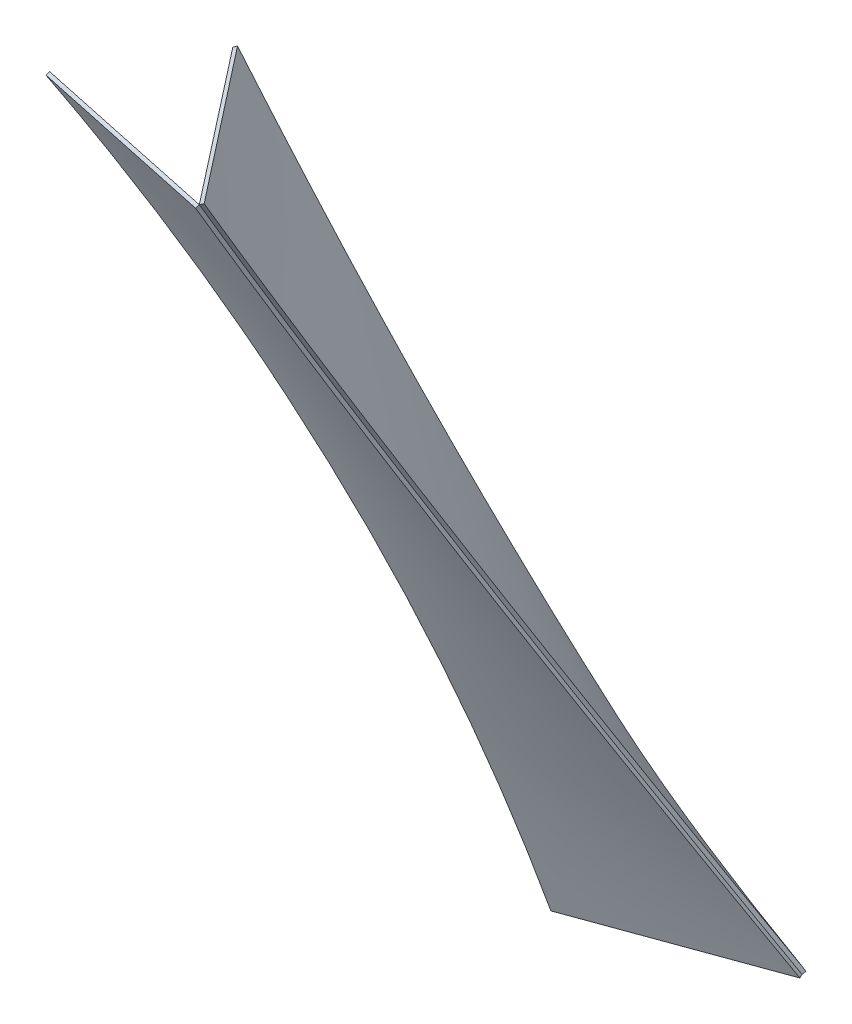
ISO-10303-21;
HEADER;
FILE_DESCRIPTION(('STEP AP214'),'2;1');
FILE_NAME('part.step','',(''),(''),'','','');
FILE_SCHEMA(('AUTOMOTIVE_DESIGN { 1 0 10303 214 1 1 1 1 }'));
ENDSEC;
DATA;
#1=APPLICATION_CONTEXT('core data for automotive mechanical design processes');
#2=APPLICATION_PROTOCOL_DEFINITION('international standard','automotive_design',2000,#1);
#3=PRODUCT_CONTEXT('',#1,'mechanical');
#4=PRODUCT('Part','Part','',(#3));
#5=PRODUCT_RELATED_PRODUCT_CATEGORY('part','',(#4));
#6=PRODUCT_DEFINITION_FORMATION('','',#4);
#7=PRODUCT_DEFINITION_CONTEXT('part definition',#1,'design');
#8=PRODUCT_DEFINITION('design','',#6,#7);
#9=PRODUCT_DEFINITION_SHAPE('','',#8);
#10=(LENGTH_UNIT() NAMED_UNIT(*) SI_UNIT(.MILLI.,.METRE.));
#11=(NAMED_UNIT(*) PLANE_ANGLE_UNIT() SI_UNIT($,.RADIAN.));
#12=(NAMED_UNIT(*) SI_UNIT($,.STERADIAN.) SOLID_ANGLE_UNIT());
#13=UNCERTAINTY_MEASURE_WITH_UNIT(LENGTH_MEASURE(1.E-05),#10,'distance_accuracy_value','');
#14=(GEOMETRIC_REPRESENTATION_CONTEXT(3) GLOBAL_UNCERTAINTY_ASSIGNED_CONTEXT((#13)) GLOBAL_UNIT_ASSIGNED_CONTEXT((#10,
#11,#12)) REPRESENTATION_CONTEXT('',''));
#15=CARTESIAN_POINT('',(0.,0.,0.));
#16=DIRECTION('',(0.,0.,1.));
#17=DIRECTION('',(1.,0.,0.));
#18=AXIS2_PLACEMENT_3D('',#15,#16,#17);
#19=CARTESIAN_POINT('',(283.480426248597,407.115147940274,134.215304998314));
#20=CARTESIAN_POINT('',(293.102632967215,372.599813988946,123.718075802583));
#21=CARTESIAN_POINT('',(301.730189499787,338.148503673204,112.263899554851));
#22=CARTESIAN_POINT('',(313.118219793948,286.690694139485,93.6386744379849));
#23=CARTESIAN_POINT('',(316.654750853913,269.574875919136,87.1888587177726));
#24=CARTESIAN_POINT('',(323.196441224416,235.437062259907,73.8110502946261));
#25=CARTESIAN_POINT('',(326.200974825531,218.415172317269,66.8828669971953));
#26=CARTESIAN_POINT('',(331.677480906214,184.480145481782,52.5723951322629));
#27=CARTESIAN_POINT('',(334.149751051378,167.566727617744,45.1912092604749));
#28=CARTESIAN_POINT('',(338.583723177891,133.860064286484,30.0067544442615));
#29=CARTESIAN_POINT('',(340.546503163389,117.06675236686,22.2037122896409));
#30=CARTESIAN_POINT('',(345.697435375216,66.8905448792094,-1.82230548124379));
#31=CARTESIAN_POINT('',(348.151520961227,33.7120815255412,-18.6648831358462));
#32=CARTESIAN_POINT('',(349.602823048063,0.876255361734513,-36.3306762111318));
#33=CARTESIAN_POINT('',(282.095540384845,406.400000000001,135.297296418014));
#34=CARTESIAN_POINT('',(291.690847970146,371.891500338426,124.770155061567));
#35=CARTESIAN_POINT('',(300.296873923827,337.451560864584,113.293710597361));
#36=CARTESIAN_POINT('',(311.704963453109,285.997877254039,94.6983478910511));
#37=CARTESIAN_POINT('',(315.25750172933,268.881020317227,88.2697776539477));
#38=CARTESIAN_POINT('',(321.859423989057,234.733279196778,74.9596149516806));
#39=CARTESIAN_POINT('',(324.908807972563,217.702395013142,68.0780224865168));
#40=CARTESIAN_POINT('',(330.501583821225,183.743830285482,53.8690251034019));
#41=CARTESIAN_POINT('',(333.044975686381,166.816149741458,46.5416201854508));
#42=CARTESIAN_POINT('',(337.622929472709,133.081223179458,31.4482076720342));
#43=CARTESIAN_POINT('',(339.65749139388,116.273977161482,23.6822000765688));
#44=CARTESIAN_POINT('',(344.993675502965,66.058737226281,-0.262912063189253));
#45=CARTESIAN_POINT('',(347.527796036448,32.8572414277833,-17.0891059608437));
#46=CARTESIAN_POINT('',(349.027229728152,2.22044604925031E-13,-34.7492465618884));
#47=B_SPLINE_SURFACE_WITH_KNOTS('',1,3,((#19,#20,#21,#22,#23,#24,#25,#26,#27,#28,#29,#30,#31,
#32),(#33,#34,#35,#36,#37,#38,#39,#40,#41,#42,#43,#44,#45,#46)),.UNSPECIFIED.,.F.,.F.,.F.,(2,2),
(4,2,2,2,2,2,4),(0.,1.),(0.,0.25,0.375,0.5,0.625,0.75,1.),.UNSPECIFIED.);
#48=CARTESIAN_POINT('',(349.027229728152,2.22044604925031E-13,-34.7492465618884));
#49=CARTESIAN_POINT('',(349.602823048063,0.876255361734513,-36.3306762111318));
#50=B_SPLINE_CURVE_WITH_KNOTS('',1,(#48,#49),.UNSPECIFIED.,.F.,.F.,(2,2),(0.,1.),.UNSPECIFIED.);
#51=CARTESIAN_POINT('',(349.027229728152,2.22044604925031E-13,-34.7492465618884));
#52=VERTEX_POINT('',#51);
#53=CARTESIAN_POINT('',(349.602823048063,0.876255361734513,-36.3306762111318));
#54=VERTEX_POINT('',#53);
#55=EDGE_CURVE('E15',#52,#54,#50,.T.);
#56=CARTESIAN_POINT('',(349.027229728152,2.22044604925031E-13,-34.7492465618884));
#57=CARTESIAN_POINT('',(347.527796036448,32.8572414277833,-17.0891059608437));
#58=CARTESIAN_POINT('',(344.993675502965,66.058737226281,-0.262912063189253));
#59=CARTESIAN_POINT('',(339.65749139388,116.273977161482,23.6822000765688));
#60=CARTESIAN_POINT('',(337.622929472709,133.081223179458,31.4482076720342));
#61=CARTESIAN_POINT('',(333.044975686381,166.816149741458,46.5416201854508));
#62=CARTESIAN_POINT('',(330.501583821225,183.743830285482,53.8690251034019));
#63=CARTESIAN_POINT('',(324.908807972563,217.702395013142,68.0780224865168));
#64=CARTESIAN_POINT('',(321.859423989057,234.733279196778,74.9596149516806));
#65=CARTESIAN_POINT('',(315.25750172933,268.881020317227,88.2697776539477));
#66=CARTESIAN_POINT('',(311.704963453109,285.997877254039,94.6983478910511));
#67=CARTESIAN_POINT('',(300.296873923827,337.451560864584,113.293710597361));
#68=CARTESIAN_POINT('',(291.690847970146,371.891500338426,124.770155061567));
#69=CARTESIAN_POINT('',(282.095540384845,406.400000000001,135.297296418014));
#70=B_SPLINE_CURVE_WITH_KNOTS('',3,(#56,#57,#58,#59,#60,#61,#62,#63,#64,#65,#66,#67,#68,#69),
.UNSPECIFIED.,.F.,.F.,(4,2,2,2,2,2,4),(0.,0.25,0.375,0.5,0.625,0.75,1.),.UNSPECIFIED.);
#71=CARTESIAN_POINT('',(282.095540384845,406.400000000001,135.297296418014));
#72=VERTEX_POINT('',#71);
#73=EDGE_CURVE('E400',#52,#72,#70,.T.);
#74=CARTESIAN_POINT('',(282.095540384845,406.400000000001,135.297296418014));
#75=CARTESIAN_POINT('',(283.480426248597,407.115147940274,134.215304998314));
#76=B_SPLINE_CURVE_WITH_KNOTS('',1,(#74,#75),.UNSPECIFIED.,.F.,.F.,(2,2),(0.,1.),.UNSPECIFIED.);
#77=CARTESIAN_POINT('',(283.480426306331,407.11514773318,134.215304935329));
#78=VERTEX_POINT('',#77);
#79=EDGE_CURVE('E233',#72,#78,#76,.T.);
#80=CARTESIAN_POINT('',(349.602823047882,0.876255361737849,-36.3306762111956));
#81=CARTESIAN_POINT('',(349.240099871018,9.08263790563876,-31.9155675708201));
#82=CARTESIAN_POINT('',(348.814421145769,17.313102822965,-27.5504380648379));
#83=CARTESIAN_POINT('',(347.83834770597,33.8147195839394,-18.9232109441992));
#84=CARTESIAN_POINT('',(347.288021832485,42.0858465129696,-14.6610578894712));
#85=CARTESIAN_POINT('',(346.063726222946,58.6665829690197,-6.23990835929512));
#86=CARTESIAN_POINT('',(345.389812897087,66.9761732599296,-2.0808657993416));
#87=CARTESIAN_POINT('',(343.918974637038,83.6315979927871,6.1341252225925));
#88=CARTESIAN_POINT('',(343.122093925375,91.9774183608499,10.1901101386662));
#89=CARTESIAN_POINT('',(341.405092606518,108.703085728666,18.1989179077324));
#90=CARTESIAN_POINT('',(340.485004405005,117.082923221257,22.1517675615271));
#91=CARTESIAN_POINT('',(338.520096268837,133.874519131975,29.9536311949481));
#92=CARTESIAN_POINT('',(337.475297405871,142.286271925648,33.8026625818279));
#93=CARTESIAN_POINT('',(335.25826603073,159.139841829301,41.3949956240023));
#94=CARTESIAN_POINT('',(334.086043777893,167.58165646603,45.1383057607868));
#95=CARTESIAN_POINT('',(331.611071659999,184.493790904879,52.5158625680249));
#96=CARTESIAN_POINT('',(330.308321777823,192.964110710737,56.1501092241751));
#97=CARTESIAN_POINT('',(327.570033861583,209.931827308746,63.3054144531532));
#98=CARTESIAN_POINT('',(326.134486123337,218.429226035806,66.8264647288001));
#99=CARTESIAN_POINT('',(323.129911697326,235.449456568774,73.7516683537776));
#100=CARTESIAN_POINT('',(321.560866234747,243.972291788835,77.1558051658582));
#101=CARTESIAN_POINT('',(318.289988246234,261.041408137913,83.8447942325126));
#102=CARTESIAN_POINT('',(316.588128369784,269.58769374461,87.1296217125031));
#103=CARTESIAN_POINT('',(313.053125301255,286.701080241914,93.5788975415301));
#104=CARTESIAN_POINT('',(311.219946442472,295.268186172347,96.7433128261156));
#105=CARTESIAN_POINT('',(305.52482721177,321.002145563866,106.057744949643));
#106=CARTESIAN_POINT('',(301.46895343523,338.193046426016,112.025581623156));
#107=CARTESIAN_POINT('',(295.007343562105,364.010568217198,120.615407924424));
#108=CARTESIAN_POINT('',(292.789617596806,372.624793055725,123.419331123184));
#109=CARTESIAN_POINT('',(288.228624447749,389.863862572055,128.907497574661));
#110=CARTESIAN_POINT('',(285.885286716036,398.488710502474,131.591671988465));
#111=CARTESIAN_POINT('',(283.480426306084,407.115147733405,134.215304935163));
#112=B_SPLINE_CURVE_WITH_KNOTS('',3,(#80,#81,#82,#83,#84,#85,#86,#87,#88,#89,#90,#91,#92,#93,
#94,#95,#96,#97,#98,#99,#100,#101,#102,#103,#104,#105,#106,#107,#108,#109,#110,#111),
.UNSPECIFIED.,.F.,.F.,(4,2,2,2,2,2,2,2,2,2,2,2,2,2,2,4),(0.,27.9768177414112,55.9382217495732,
83.8868946907719,111.82553982812,139.756851003789,167.683449439103,195.607801061416,
223.532156345865,251.458553812186,279.38888529546,307.324983735459,335.268698699666,
391.184239540729,419.162696518367,447.157035260678),.UNSPECIFIED.);
#113=EDGE_CURVE('E286',#54,#78,#112,.T.);
#114=ORIENTED_EDGE('',*,*,#55,.F.);
#115=ORIENTED_EDGE('',*,*,#73,.T.);
#116=ORIENTED_EDGE('',*,*,#79,.T.);
#117=ORIENTED_EDGE('',*,*,#113,.F.);
#118=EDGE_LOOP('',(#114,#115,#116,#117));
#119=FACE_BOUND('',#118,.T.);
#120=ADVANCED_FACE('F219',(#119),#47,.F.);
#121=CARTESIAN_POINT('',(283.480426248597,407.115147940274,134.215304998314));
#122=CARTESIAN_POINT('',(304.341655745825,407.081381650881,160.894143123353));
#123=CARTESIAN_POINT('',(325.202523604188,407.045959245197,187.573263792203));
#124=CARTESIAN_POINT('',(346.062833931183,407.008846790874,214.2528200551));
#125=CARTESIAN_POINT('',(282.095540384845,406.400000000001,135.297296418014));
#126=CARTESIAN_POINT('',(302.9459423492,406.400000000001,161.984593940168));
#127=CARTESIAN_POINT('',(323.796344313554,406.400000000001,188.671891462322));
#128=CARTESIAN_POINT('',(344.646746277909,406.4,215.359188984475));
#129=B_SPLINE_SURFACE_WITH_KNOTS('',1,3,((#121,#122,#123,#124),(#125,#126,#127,#128)),
.UNSPECIFIED.,.F.,.F.,.F.,(2,2),(4,4),(0.,1.),(-0.0508,0.0508),.UNSPECIFIED.);
#130=CARTESIAN_POINT('',(282.095540384845,406.400000000001,135.297296418014));
#131=CARTESIAN_POINT('',(302.9459423492,406.400000000001,161.984593940168));
#132=CARTESIAN_POINT('',(323.796344313554,406.400000000001,188.671891462322));
#133=CARTESIAN_POINT('',(344.646746277909,406.4,215.359188984475));
#134=B_SPLINE_CURVE_WITH_KNOTS('',3,(#130,#131,#132,#133),.UNSPECIFIED.,.F.,.F.,(4,4),(-0.0508,
0.0508),.UNSPECIFIED.);
#135=CARTESIAN_POINT('',(344.646746277909,406.4,215.359188984476));
#136=VERTEX_POINT('',#135);
#137=EDGE_CURVE('E269',#72,#136,#134,.T.);
#138=CARTESIAN_POINT('',(344.646746277909,406.4,215.359188984475));
#139=CARTESIAN_POINT('',(346.062833931183,407.008846790874,214.2528200551));
#140=B_SPLINE_CURVE_WITH_KNOTS('',1,(#138,#139),.UNSPECIFIED.,.F.,.F.,(2,2),(0.,1.),.UNSPECIFIED.);
#141=CARTESIAN_POINT('',(346.062833931183,407.008846790874,214.2528200551));
#142=VERTEX_POINT('',#141);
#143=EDGE_CURVE('E263',#136,#142,#140,.T.);
#144=CARTESIAN_POINT('',(283.480426248359,407.115147940457,134.21530499813));
#145=CARTESIAN_POINT('',(286.088079947018,407.110927158042,137.550159783986));
#146=CARTESIAN_POINT('',(288.695727945964,407.106680561834,140.885018994006));
#147=CARTESIAN_POINT('',(293.911011848777,407.098135536436,147.554746863921));
#148=CARTESIAN_POINT('',(296.518647752643,407.093837107244,150.889615523814));
#149=CARTESIAN_POINT('',(301.733906741269,407.085188210523,157.559362858737));
#150=CARTESIAN_POINT('',(304.341529826029,407.080837742994,160.894241533766));
#151=CARTESIAN_POINT('',(309.556762432614,407.072084597095,167.564009480514));
#152=CARTESIAN_POINT('',(312.164371954438,407.067681918725,170.898898752233));
#153=CARTESIAN_POINT('',(317.379576677345,407.058824201823,177.568688484272));
#154=CARTESIAN_POINT('',(319.987171878427,407.054369163289,180.903588944592));
#155=CARTESIAN_POINT('',(325.202347186215,407.045406606439,187.573401658213));
#156=CARTESIAN_POINT('',(327.809927292921,407.040899088121,190.908313911514));
#157=CARTESIAN_POINT('',(333.0250716247,407.031831478119,197.578150825739));
#158=CARTESIAN_POINT('',(335.632635849773,407.027271386435,200.913075486664));
#159=CARTESIAN_POINT('',(340.847747613793,407.018098574256,207.582937845549));
#160=CARTESIAN_POINT('',(343.45529515274,407.013485853759,210.917875543509));
#161=CARTESIAN_POINT('',(346.06283393083,407.008846791162,214.252820054807));
#162=B_SPLINE_CURVE_WITH_KNOTS('',3,(#144,#145,#146,#147,#148,#149,#150,#151,#152,#153,#154,
#155,#156,#157,#158,#159,#160,#161),.UNSPECIFIED.,.F.,.F.,(4,2,2,2,2,2,2,2,4),(0.,
12.700007426256,25.4000149913132,38.1000226958042,50.8000305422378,63.5000385317466,
76.2000466656416,88.9000549442848,101.600063371033),.UNSPECIFIED.);
#163=EDGE_CURVE('E267',#78,#142,#162,.T.);
#164=ORIENTED_EDGE('',*,*,#79,.F.);
#165=ORIENTED_EDGE('',*,*,#137,.T.);
#166=ORIENTED_EDGE('',*,*,#143,.T.);
#167=ORIENTED_EDGE('',*,*,#163,.F.);
#168=EDGE_LOOP('',(#164,#165,#166,#167));
#169=FACE_BOUND('',#168,.T.);
#170=ADVANCED_FACE('F266',(#169),#129,.T.);
#171=CARTESIAN_POINT('',(346.062833931183,407.008846790874,214.2528200551));
#172=CARTESIAN_POINT('',(344.503124445613,373.004718761286,193.543643428624));
#173=CARTESIAN_POINT('',(345.478135380388,338.761934274698,173.375025250805));
#174=CARTESIAN_POINT('',(350.620764703854,287.372750087332,144.056243355413));
#175=CARTESIAN_POINT('',(352.947843977509,270.238870368892,134.438558044962));
#176=CARTESIAN_POINT('',(358.809014509915,236.011678012852,115.540490642943));
#177=CARTESIAN_POINT('',(362.3427141303,218.918123985283,106.260050024696));
#178=CARTESIAN_POINT('',(370.611102554996,184.814573098306,88.0781879981933));
#179=CARTESIAN_POINT('',(375.346284493722,167.804131136307,79.1774958532089));
#180=CARTESIAN_POINT('',(386.02706520242,133.916301981808,61.8022544967587));
#181=CARTESIAN_POINT('',(391.97334138883,117.039171021898,53.3278721957763));
#182=CARTESIAN_POINT('',(411.630740066822,66.6986870500157,28.5948082588322));
#183=CARTESIAN_POINT('',(427.162584969943,33.528869652693,13.0252852567222));
#184=CARTESIAN_POINT('',(445.054462602135,0.985877948736179,-1.52337347929811));
#185=CARTESIAN_POINT('',(344.646746277909,406.4,215.359188984476));
#186=CARTESIAN_POINT('',(343.069760960772,372.365283308004,194.611067030106));
#187=CARTESIAN_POINT('',(344.038685553392,338.082034115787,174.40936039772));
#188=CARTESIAN_POINT('',(349.230626413037,286.611224709503,145.099634502726));
#189=CARTESIAN_POINT('',(351.584365694704,269.446632304415,135.495198213326));
#190=CARTESIAN_POINT('',(357.524643765958,235.156612810315,116.646138830824));
#191=CARTESIAN_POINT('',(361.111182555544,218.031185721302,107.401515737721));
#192=CARTESIAN_POINT('',(369.503674493647,183.873974048082,89.300951259582));
#193=CARTESIAN_POINT('',(374.309627642165,166.842189463874,80.4450098745455));
#194=CARTESIAN_POINT('',(385.127563149145,132.926739988992,63.1506773243072));
#195=CARTESIAN_POINT('',(391.139545507607,116.043075098317,54.7122861591054));
#196=CARTESIAN_POINT('',(410.964458674432,65.6959757496868,30.0667407609053));
#197=CARTESIAN_POINT('',(426.566355574231,32.5364366151237,14.5292146253119));
#198=CARTESIAN_POINT('',(444.5,-1.66533453693773E-13,0.));
#199=B_SPLINE_SURFACE_WITH_KNOTS('',1,3,((#171,#172,#173,#174,#175,#176,#177,#178,#179,#180,
#181,#182,#183,#184),(#185,#186,#187,#188,#189,#190,#191,#192,#193,#194,#195,#196,#197,#198)),
.UNSPECIFIED.,.F.,.F.,.F.,(2,2),(4,2,2,2,2,2,4),(0.,1.),(0.,0.25,0.375,0.5,0.625,0.75,1.),.UNSPECIFIED.);
#200=CARTESIAN_POINT('',(344.646746277909,406.4,215.359188984476));
#201=CARTESIAN_POINT('',(343.069760960772,372.365283308004,194.611067030106));
#202=CARTESIAN_POINT('',(344.038685553392,338.082034115787,174.40936039772));
#203=CARTESIAN_POINT('',(349.230626413037,286.611224709503,145.099634502726));
#204=CARTESIAN_POINT('',(351.584365694704,269.446632304415,135.495198213326));
#205=CARTESIAN_POINT('',(357.524643765958,235.156612810315,116.646138830824));
#206=CARTESIAN_POINT('',(361.111182555544,218.031185721302,107.401515737721));
#207=CARTESIAN_POINT('',(369.503674493647,183.873974048082,89.300951259582));
#208=CARTESIAN_POINT('',(374.309627642165,166.842189463874,80.4450098745455));
#209=CARTESIAN_POINT('',(385.127563149145,132.926739988992,63.1506773243072));
#210=CARTESIAN_POINT('',(391.139545507607,116.043075098317,54.7122861591054));
#211=CARTESIAN_POINT('',(410.964458674432,65.6959757496868,30.0667407609053));
#212=CARTESIAN_POINT('',(426.566355574231,32.5364366151237,14.5292146253119));
#213=CARTESIAN_POINT('',(444.5,-1.66533453693773E-13,0.));
#214=B_SPLINE_CURVE_WITH_KNOTS('',3,(#200,#201,#202,#203,#204,#205,#206,#207,#208,#209,#210,
#211,#212,#213),.UNSPECIFIED.,.F.,.F.,(4,2,2,2,2,2,4),(0.,0.25,0.375,0.5,0.625,0.75,1.),.UNSPECIFIED.);
#215=CARTESIAN_POINT('',(444.5,-1.66533453693773E-13,0.));
#216=VERTEX_POINT('',#215);
#217=EDGE_CURVE('E288',#136,#216,#214,.T.);
#218=CARTESIAN_POINT('',(444.5,-1.66533453693773E-13,0.));
#219=CARTESIAN_POINT('',(445.054462602135,0.985877948736179,-1.52337347929811));
#220=B_SPLINE_CURVE_WITH_KNOTS('',1,(#218,#219),.UNSPECIFIED.,.F.,.F.,(2,2),(0.,1.),.UNSPECIFIED.);
#221=CARTESIAN_POINT('',(445.054462602135,0.985877948736179,-1.52337347929811));
#222=VERTEX_POINT('',#221);
#223=EDGE_CURVE('E276',#216,#222,#220,.T.);
#224=CARTESIAN_POINT('',(346.06283393083,407.008846791162,214.252820054807));
#225=CARTESIAN_POINT('',(345.673220678684,398.516785906841,209.080934559933));
#226=CARTESIAN_POINT('',(345.441376011304,390.000450383714,203.93709665155));
#227=CARTESIAN_POINT('',(345.29258712934,372.944736941613,193.719655690365));
#228=CARTESIAN_POINT('',(345.375052349292,364.405432332403,188.645938878207));
#229=CARTESIAN_POINT('',(345.852411988717,347.31085964554,178.571399732848));
#230=CARTESIAN_POINT('',(346.246811685106,338.755638228495,173.570474732579));
#231=CARTESIAN_POINT('',(347.345296055367,321.636224812641,163.643983500109));
#232=CARTESIAN_POINT('',(348.048979811253,313.072058699416,158.718328222776));
#233=CARTESIAN_POINT('',(349.763267923625,295.941512626446,148.944928169261));
#234=CARTESIAN_POINT('',(350.773563020718,287.375143547528,144.097110047447));
#235=CARTESIAN_POINT('',(353.098413910572,270.246560033643,134.482322466021));
#236=CARTESIAN_POINT('',(354.412750033675,261.684347050233,129.715297289582));
#237=CARTESIAN_POINT('',(357.343467267171,244.569945640804,120.265818765671));
#238=CARTESIAN_POINT('',(358.959715991428,236.017754467986,115.583329333146));
#239=CARTESIAN_POINT('',(362.492923028898,218.928850252268,106.307689042516));
#240=CARTESIAN_POINT('',(364.409833622508,210.392134970234,101.714524137061));
#241=CARTESIAN_POINT('',(368.544218574985,193.339590732998,92.6231960090914));
#242=CARTESIAN_POINT('',(370.761727153518,184.823764268283,88.1250436701601));
#243=CARTESIAN_POINT('',(375.498165743119,167.818884994016,79.2296717990902));
#244=CARTESIAN_POINT('',(378.017209399642,159.32984352445,74.832491070968));
#245=CARTESIAN_POINT('',(383.357833243138,142.385218246143,66.1445052380803));
#246=CARTESIAN_POINT('',(386.179604282424,133.929659070155,61.8537693641369));
#247=CARTESIAN_POINT('',(392.126203017669,117.059369260881,53.3832316996979));
#248=CARTESIAN_POINT('',(395.251296742446,108.644681389779,49.2035314599015));
#249=CARTESIAN_POINT('',(401.804035941413,91.863818006113,40.9588263133719));
#250=CARTESIAN_POINT('',(405.232020865737,83.4977084133323,36.8939570037441));
#251=CARTESIAN_POINT('',(412.389076001461,66.8216489525706,28.8821960316776));
#252=CARTESIAN_POINT('',(416.118557873769,58.5117932496399,24.9354761123918));
#253=CARTESIAN_POINT('',(423.876540102027,41.9557067753692,17.1631169559071));
#254=CARTESIAN_POINT('',(427.905523912314,33.7096036809521,13.337688353123));
#255=CARTESIAN_POINT('',(436.260033995469,17.2881865709434,5.81098391783739));
#256=CARTESIAN_POINT('',(440.586115539097,9.11303914652983,2.10996093700732));
#257=CARTESIAN_POINT('',(445.054462602134,0.985877948714294,-1.52337347931256));
#258=B_SPLINE_CURVE_WITH_KNOTS('',3,(#224,#225,#226,#227,#228,#229,#230,#231,#232,#233,#234,
#235,#236,#237,#238,#239,#240,#241,#242,#243,#244,#245,#246,#247,#248,#249,#250,#251,#252,#253,
#254,#255,#256,#257),.UNSPECIFIED.,.F.,.F.,(4,2,2,2,2,2,2,2,2,2,2,2,2,2,2,2,4),(0.,
29.8505538917363,59.645048433408,89.39238391077,119.101271791318,148.780293235259,
178.437938190144,208.082608915207,237.722579333277,267.365926763306,297.020481850919,
326.693843543077,356.393469520957,386.126812588023,415.901462114417,445.725263423091,
475.606407253072),.UNSPECIFIED.);
#259=EDGE_CURVE('E284',#142,#222,#258,.T.);
#260=ORIENTED_EDGE('',*,*,#143,.F.);
#261=ORIENTED_EDGE('',*,*,#217,.T.);
#262=ORIENTED_EDGE('',*,*,#223,.T.);
#263=ORIENTED_EDGE('',*,*,#259,.F.);
#264=EDGE_LOOP('',(#260,#261,#262,#263));
#265=FACE_BOUND('',#264,.T.);
#266=ADVANCED_FACE('F293',(#265),#199,.T.);
#267=CARTESIAN_POINT('',(445.054462602135,0.985877948736179,-1.52337347929812));
#268=CARTESIAN_POINT('',(413.237453128719,0.951034516117287,-13.1263674114279));
#269=CARTESIAN_POINT('',(381.420272937055,0.914478748856112,-24.7288923003632));
#270=CARTESIAN_POINT('',(349.602823048063,0.876255361734513,-36.3306762111318));
#271=CARTESIAN_POINT('',(444.5,-1.66533453693773E-13,0.));
#272=CARTESIAN_POINT('',(412.675743242718,0.,-11.583082187296));
#273=CARTESIAN_POINT('',(380.851486485435,0.,-23.1661643745923));
#274=CARTESIAN_POINT('',(349.027229728152,2.22044604925031E-13,-34.7492465618884));
#275=B_SPLINE_SURFACE_WITH_KNOTS('',1,3,((#267,#268,#269,#270),(#271,#272,#273,#274)),
.UNSPECIFIED.,.F.,.F.,.F.,(2,2),(4,4),(0.,1.),(-0.0507999999999999,0.0507999999999999),.UNSPECIFIED.);
#276=CARTESIAN_POINT('',(444.5,-1.66533453693773E-13,0.));
#277=CARTESIAN_POINT('',(412.675743242718,0.,-11.583082187296));
#278=CARTESIAN_POINT('',(380.851486485435,0.,-23.1661643745923));
#279=CARTESIAN_POINT('',(349.027229728152,2.22044604925031E-13,-34.7492465618884));
#280=B_SPLINE_CURVE_WITH_KNOTS('',3,(#276,#277,#278,#279),.UNSPECIFIED.,.F.,.F.,(4,4),
(-0.0507999999999999,0.0507999999999999),.UNSPECIFIED.);
#281=EDGE_CURVE('E394',#216,#52,#280,.T.);
#282=CARTESIAN_POINT('',(445.054462602134,0.985877948714294,-1.52337347931256));
#283=CARTESIAN_POINT('',(441.077336395688,0.98152252600055,-2.97374772601556));
#284=CARTESIAN_POINT('',(437.1002075329,0.977140436234541,-4.42411460859462));
#285=CARTESIAN_POINT('',(429.145944077765,0.968322994860882,-7.32483263191693));
#286=CARTESIAN_POINT('',(425.168809485418,0.963887643252667,-8.77518377266001));
#287=CARTESIAN_POINT('',(417.214534196683,0.954963750502792,-11.6758692832613));
#288=CARTESIAN_POINT('',(413.237393500296,0.950475209360568,-13.1262036531194));
#289=CARTESIAN_POINT('',(405.28310562258,0.941445055787956,-16.0268545757377));
#290=CARTESIAN_POINT('',(401.305958441251,0.936903443357004,-17.4771711284978));
#291=CARTESIAN_POINT('',(393.35165720866,0.92776730040043,-20.3777853591345));
#292=CARTESIAN_POINT('',(389.374503157397,0.923172769874245,-21.8280830370109));
#293=CARTESIAN_POINT('',(381.420187795695,0.913930984041799,-24.7286584480455));
#294=CARTESIAN_POINT('',(377.443026485256,0.90928372873498,-26.1789361812034));
#295=CARTESIAN_POINT('',(369.48869621212,0.899936722766198,-29.0794706233935));
#296=CARTESIAN_POINT('',(365.511527249423,0.89523697210368,-30.5297273324254));
#297=CARTESIAN_POINT('',(357.557181274638,0.885785256924368,-33.43021863502));
#298=CARTESIAN_POINT('',(353.580004262549,0.881033292407027,-34.8804532285824));
#299=CARTESIAN_POINT('',(349.602823047882,0.876255361737849,-36.3306762111956));
#300=B_SPLINE_CURVE_WITH_KNOTS('',3,(#282,#283,#284,#285,#286,#287,#288,#289,#290,#291,#292,
#293,#294,#295,#296,#297,#298,#299),.UNSPECIFIED.,.F.,.F.,(4,2,2,2,2,2,2,2,4),(0.,
12.7000092749063,25.4000186849667,38.1000282299548,50.8000379099932,63.5000477247575,
76.2000576734174,88.9000677560289,101.60007797167),.UNSPECIFIED.);
#301=EDGE_CURVE('E296',#222,#54,#300,.T.);
#302=ORIENTED_EDGE('',*,*,#281,.T.);
#303=ORIENTED_EDGE('',*,*,#55,.T.);
#304=ORIENTED_EDGE('',*,*,#301,.F.);
#305=ORIENTED_EDGE('',*,*,#223,.F.);
#306=EDGE_LOOP('',(#302,#303,#304,#305));
#307=FACE_BOUND('',#306,.T.);
#308=ADVANCED_FACE('F221',(#307),#275,.T.);
#309=CARTESIAN_POINT('',(344.646746277909,406.4,215.359188984476));
#310=CARTESIAN_POINT('',(282.095540384845,406.400000000001,135.297296418014));
#311=CARTESIAN_POINT('',(338.338805009361,270.261133232017,132.366701166998));
#312=CARTESIAN_POINT('',(320.476770726048,268.366001353699,93.1887309922261));
#313=CARTESIAN_POINT('',(372.765422296924,130.145746460496,58.1168585012476));
#314=CARTESIAN_POINT('',(343.029494961337,131.428965711133,35.8913158422902));
#315=CARTESIAN_POINT('',(444.5,-1.66533453693773E-13,0.));
#316=CARTESIAN_POINT('',(349.027229728152,2.22044604925031E-13,-34.7492465618884));
#317=B_SPLINE_SURFACE_WITH_KNOTS('',3,1,((#309,#310),(#311,#312),(#313,#314),(#315,#316)),
.UNSPECIFIED.,.F.,.F.,.F.,(4,4),(2,2),(0.,1.),(0.,1.),.UNSPECIFIED.);
#318=OFFSET_SURFACE('',#317,1.89738,.F.);
#319=ORIENTED_EDGE('',*,*,#259,.T.);
#320=ORIENTED_EDGE('',*,*,#301,.T.);
#321=ORIENTED_EDGE('',*,*,#113,.T.);
#322=ORIENTED_EDGE('',*,*,#163,.T.);
#323=EDGE_LOOP('',(#319,#320,#321,#322));
#324=FACE_BOUND('',#323,.T.);
#325=ADVANCED_FACE('F282',(#324),#318,.T.);
#326=CARTESIAN_POINT('',(344.646746277909,406.4,215.359188984476));
#327=CARTESIAN_POINT('',(282.095540384845,406.400000000001,135.297296418014));
#328=CARTESIAN_POINT('',(338.338805009361,270.261133232017,132.366701166998));
#329=CARTESIAN_POINT('',(320.476770726048,268.366001353699,93.1887309922261));
#330=CARTESIAN_POINT('',(372.765422296924,130.145746460496,58.1168585012476));
#331=CARTESIAN_POINT('',(343.029494961337,131.428965711133,35.8913158422902));
#332=CARTESIAN_POINT('',(444.5,-1.66533453693773E-13,0.));
#333=CARTESIAN_POINT('',(349.027229728152,2.22044604925031E-13,-34.7492465618884));
#334=B_SPLINE_SURFACE_WITH_KNOTS('',3,1,((#326,#327),(#328,#329),(#330,#331),(#332,#333)),
.UNSPECIFIED.,.F.,.F.,.F.,(4,4),(2,2),(0.,1.),(0.,1.),.UNSPECIFIED.);
#335=ORIENTED_EDGE('',*,*,#217,.F.);
#336=ORIENTED_EDGE('',*,*,#137,.F.);
#337=ORIENTED_EDGE('',*,*,#73,.F.);
#338=ORIENTED_EDGE('',*,*,#281,.F.);
#339=EDGE_LOOP('',(#335,#336,#337,#338));
#340=FACE_BOUND('',#339,.T.);
#341=ADVANCED_FACE('F390',(#340),#334,.F.);
#342=CLOSED_SHELL('',(#120,#170,#266,#308,#325,#341));
#343=MANIFOLD_SOLID_BREP('B2',#342);
#344=CARTESIAN_POINT('',(245.26695004336,406.4,194.235361197362));
#345=CARTESIAN_POINT('',(257.584177815995,375.005181221022,177.613255251539));
#346=CARTESIAN_POINT('',(269.007567114033,342.899198289846,161.787472484622));
#347=CARTESIAN_POINT('',(284.775122877176,293.778330117597,139.284431011831));
#348=CARTESIAN_POINT('',(289.803053434238,277.244391764267,131.989355967165));
#349=CARTESIAN_POINT('',(299.398610075053,243.873359207911,117.817941421897));
#350=CARTESIAN_POINT('',(303.966236158807,227.036265004887,110.941601921296));
#351=CARTESIAN_POINT('',(312.636722107669,193.076396157946,97.6145164490303));
#352=CARTESIAN_POINT('',(316.739581972777,175.953621514029,91.1637704773652));
#353=CARTESIAN_POINT('',(324.476073739012,141.439867194104,78.6947300478415));
#354=CARTESIAN_POINT('',(328.109705640139,124.048887518097,72.676435589983));
#355=CARTESIAN_POINT('',(338.300066779541,71.4998540551395,55.280516464423));
#356=CARTESIAN_POINT('',(344.146261453838,35.9657058332562,44.5618560447373));
#357=CARTESIAN_POINT('',(349.027229728152,0.,34.7492465618884));
#358=CARTESIAN_POINT('',(244.928598431262,405.424458743445,195.827180379226));
#359=CARTESIAN_POINT('',(257.234854852821,374.063388031996,179.223424795185));
#360=CARTESIAN_POINT('',(268.665370127116,341.995809262793,163.422843150536));
#361=CARTESIAN_POINT('',(284.527778868219,292.947628141713,140.972834177115));
#362=CARTESIAN_POINT('',(289.601940658472,276.440657755336,133.697740617934));
#363=CARTESIAN_POINT('',(299.319399609687,243.129855474155,119.56320378634));
#364=CARTESIAN_POINT('',(303.96281027104,226.326160875259,112.70325481648));
#365=CARTESIAN_POINT('',(312.792670755767,192.435153298645,99.3955746034098));
#366=CARTESIAN_POINT('',(316.977968191176,175.347551232383,92.947609975531));
#367=CARTESIAN_POINT('',(324.858078995974,140.897677288615,80.474149790531));
#368=CARTESIAN_POINT('',(328.552632765542,123.535220451137,74.4492333788021));
#369=CARTESIAN_POINT('',(338.883367203054,71.0577888520817,57.0342517795508));
#370=CARTESIAN_POINT('',(344.767923812737,35.5528375733308,46.30651521805));
#371=CARTESIAN_POINT('',(349.662324058987,-0.389877485774386,36.4941538950805));
#372=B_SPLINE_SURFACE_WITH_KNOTS('',1,3,((#344,#345,#346,#347,#348,#349,#350,#351,#352,#353,
#354,#355,#356,#357),(#358,#359,#360,#361,#362,#363,#364,#365,#366,#367,#368,#369,#370,#371)),
.UNSPECIFIED.,.F.,.F.,.F.,(2,2),(4,2,2,2,2,2,4),(0.,1.),(0.,0.25,0.375,0.5,0.625,0.75,1.),.UNSPECIFIED.);
#373=CARTESIAN_POINT('',(349.662324058987,-0.389877485774386,36.4941538950805));
#374=CARTESIAN_POINT('',(349.027229728152,0.,34.7492465618884));
#375=B_SPLINE_CURVE_WITH_KNOTS('',1,(#373,#374),.UNSPECIFIED.,.F.,.F.,(2,2),(0.,1.),.UNSPECIFIED.);
#376=CARTESIAN_POINT('',(349.662324058987,-0.389877485774386,36.4941538950805));
#377=VERTEX_POINT('',#376);
#378=CARTESIAN_POINT('',(349.027229728152,0.,34.7492465618884));
#379=VERTEX_POINT('',#378);
#380=EDGE_CURVE('E217',#377,#379,#375,.T.);
#381=CARTESIAN_POINT('',(349.662324058987,-0.389877485774386,36.4941538950805));
#382=CARTESIAN_POINT('',(344.767923812737,35.5528375733308,46.30651521805));
#383=CARTESIAN_POINT('',(338.883367203054,71.0577888520817,57.0342517795508));
#384=CARTESIAN_POINT('',(328.552632765542,123.535220451137,74.4492333788021));
#385=CARTESIAN_POINT('',(324.858078995974,140.897677288615,80.474149790531));
#386=CARTESIAN_POINT('',(316.977968191176,175.347551232383,92.947609975531));
#387=CARTESIAN_POINT('',(312.792670755767,192.435153298645,99.3955746034098));
#388=CARTESIAN_POINT('',(303.96281027104,226.326160875259,112.70325481648));
#389=CARTESIAN_POINT('',(299.319399609687,243.129855474155,119.56320378634));
#390=CARTESIAN_POINT('',(289.601940658472,276.440657755336,133.697740617934));
#391=CARTESIAN_POINT('',(284.527778868219,292.947628141713,140.972834177115));
#392=CARTESIAN_POINT('',(268.665370127116,341.995809262793,163.422843150536));
#393=CARTESIAN_POINT('',(257.234854852821,374.063388031996,179.223424795185));
#394=CARTESIAN_POINT('',(244.928598431262,405.424458743445,195.827180379226));
#395=B_SPLINE_CURVE_WITH_KNOTS('',3,(#381,#382,#383,#384,#385,#386,#387,#388,#389,#390,#391,
#392,#393,#394),.UNSPECIFIED.,.F.,.F.,(4,2,2,2,2,2,4),(0.,0.25,0.375,0.5,0.625,0.75,1.),.UNSPECIFIED.);
#396=CARTESIAN_POINT('',(244.928598431262,405.424458743445,195.827180379226));
#397=VERTEX_POINT('',#396);
#398=EDGE_CURVE('E722',#377,#397,#395,.T.);
#399=CARTESIAN_POINT('',(244.928598431262,405.424458743445,195.827180379226));
#400=CARTESIAN_POINT('',(245.26695004336,406.4,194.235361197362));
#401=B_SPLINE_CURVE_WITH_KNOTS('',1,(#399,#400),.UNSPECIFIED.,.F.,.F.,(2,2),(0.,1.),.UNSPECIFIED.);
#402=CARTESIAN_POINT('',(245.26695004336,406.4,194.235361197362));
#403=VERTEX_POINT('',#402);
#404=EDGE_CURVE('E670',#397,#403,#401,.T.);
#405=CARTESIAN_POINT('',(349.027229728152,0.,34.7492465618884));
#406=CARTESIAN_POINT('',(329.503356630898,143.862823333024,73.9996844932842));
#407=CARTESIAN_POINT('',(294.535861133899,280.820724884085,127.746937414068));
#408=CARTESIAN_POINT('',(245.26695004336,406.4,194.235361197362));
#409=B_SPLINE_CURVE_WITH_KNOTS('',3,(#405,#406,#407,#408),.UNSPECIFIED.,.F.,.F.,(4,4),(0.,1.),.UNSPECIFIED.);
#410=EDGE_CURVE('E892',#379,#403,#409,.T.);
#411=ORIENTED_EDGE('',*,*,#380,.F.);
#412=ORIENTED_EDGE('',*,*,#398,.T.);
#413=ORIENTED_EDGE('',*,*,#404,.T.);
#414=ORIENTED_EDGE('',*,*,#410,.F.);
#415=EDGE_LOOP('',(#411,#412,#413,#414));
#416=FACE_BOUND('',#415,.T.);
#417=ADVANCED_FACE('F656',(#416),#372,.F.);
#418=CARTESIAN_POINT('',(245.26695004336,406.4,194.235361197362));
#419=CARTESIAN_POINT('',(278.39354878821,406.4,201.2766371264));
#420=CARTESIAN_POINT('',(311.520147533059,406.4,208.317913055438));
#421=CARTESIAN_POINT('',(344.646746277909,406.4,215.359188984475));
#422=CARTESIAN_POINT('',(244.928598431262,405.424458743445,195.827180379226));
#423=CARTESIAN_POINT('',(278.054507382016,405.429993317086,202.871701533625));
#424=CARTESIAN_POINT('',(311.180475624469,405.43511523512,209.915943743736));
#425=CARTESIAN_POINT('',(344.306490204904,405.439904498902,216.959967950465));
#426=B_SPLINE_SURFACE_WITH_KNOTS('',1,3,((#418,#419,#420,#421),(#422,#423,#424,#425)),
.UNSPECIFIED.,.F.,.F.,.F.,(2,2),(4,4),(0.,1.),(-0.0508,0.0508),.UNSPECIFIED.);
#427=CARTESIAN_POINT('',(244.928598431262,405.424458743445,195.827180379226));
#428=CARTESIAN_POINT('',(278.054507382016,405.429993317086,202.871701533625));
#429=CARTESIAN_POINT('',(311.180475624469,405.43511523512,209.915943743736));
#430=CARTESIAN_POINT('',(344.306490204904,405.439904498902,216.959967950465));
#431=B_SPLINE_CURVE_WITH_KNOTS('',3,(#427,#428,#429,#430),.UNSPECIFIED.,.F.,.F.,(4,4),(-0.0508,
0.0508),.UNSPECIFIED.);
#432=CARTESIAN_POINT('',(344.306490204904,405.439904498902,216.959967950465));
#433=VERTEX_POINT('',#432);
#434=EDGE_CURVE('E915',#397,#433,#431,.T.);
#435=CARTESIAN_POINT('',(344.306490204904,405.439904498902,216.959967950465));
#436=CARTESIAN_POINT('',(344.646746277909,406.4,215.359188984475));
#437=B_SPLINE_CURVE_WITH_KNOTS('',1,(#435,#436),.UNSPECIFIED.,.F.,.F.,(2,2),(0.,1.),.UNSPECIFIED.);
#438=CARTESIAN_POINT('',(344.646746277909,406.4,215.359188984476));
#439=VERTEX_POINT('',#438);
#440=EDGE_CURVE('E712',#433,#439,#437,.T.);
#441=CARTESIAN_POINT('',(245.26695004336,406.4,194.235361197362));
#442=CARTESIAN_POINT('',(344.646746277909,406.4,215.359188984476));
#443=B_SPLINE_CURVE_WITH_KNOTS('',1,(#441,#442),.UNSPECIFIED.,.F.,.F.,(2,2),(0.,1.),.UNSPECIFIED.);
#444=EDGE_CURVE('E730',#403,#439,#443,.T.);
#445=ORIENTED_EDGE('',*,*,#404,.F.);
#446=ORIENTED_EDGE('',*,*,#434,.T.);
#447=ORIENTED_EDGE('',*,*,#440,.T.);
#448=ORIENTED_EDGE('',*,*,#444,.F.);
#449=EDGE_LOOP('',(#445,#446,#447,#448));
#450=FACE_BOUND('',#449,.T.);
#451=ADVANCED_FACE('F753',(#450),#426,.T.);
#452=CARTESIAN_POINT('',(344.646746277909,406.4,215.359188984476));
#453=CARTESIAN_POINT('',(343.069760960772,372.365283308004,194.611067030106));
#454=CARTESIAN_POINT('',(344.038685553392,338.082034115787,174.40936039772));
#455=CARTESIAN_POINT('',(349.230626413037,286.611224709503,145.099634502726));
#456=CARTESIAN_POINT('',(351.584365694704,269.446632304415,135.495198213326));
#457=CARTESIAN_POINT('',(357.524643765958,235.156612810315,116.646138830824));
#458=CARTESIAN_POINT('',(361.111182555544,218.031185721302,107.401515737721));
#459=CARTESIAN_POINT('',(369.503674493647,183.873974048082,89.300951259582));
#460=CARTESIAN_POINT('',(374.309627642165,166.842189463874,80.4450098745455));
#461=CARTESIAN_POINT('',(385.127563149145,132.926739988992,63.1506773243072));
#462=CARTESIAN_POINT('',(391.139545507607,116.043075098317,54.7122861591054));
#463=CARTESIAN_POINT('',(404.35615428549,82.4783421992304,38.2819225603053));
#464=CARTESIAN_POINT('',(411.560780704911,65.7972741908178,30.289950126707));
#465=CARTESIAN_POINT('',(427.149292455723,32.6922122449835,14.7812925028823));
#466=CARTESIAN_POINT('',(435.533177787116,16.2682183075618,7.26460731265602));
#467=CARTESIAN_POINT('',(444.5,-1.66533453693773E-13,0.));
#468=CARTESIAN_POINT('',(344.306490204904,405.439904498902,216.959967950465));
#469=CARTESIAN_POINT('',(342.722656369897,371.410040716734,196.213300917197));
#470=CARTESIAN_POINT('',(343.701156478573,337.12629415496,176.014358591693));
#471=CARTESIAN_POINT('',(348.976949691632,285.664293574725,146.724397157158));
#472=CARTESIAN_POINT('',(351.370663482857,268.504481935676,137.129151032798));
#473=CARTESIAN_POINT('',(357.417589309035,234.234795788983,118.302010351008));
#474=CARTESIAN_POINT('',(361.071092565961,217.125233929423,109.07000785588));
#475=CARTESIAN_POINT('',(369.611393023024,183.016344077445,90.9918354533479));
#476=CARTESIAN_POINT('',(374.497542669103,166.017173341755,82.1453208456511));
#477=CARTESIAN_POINT('',(385.463323438649,132.178296635244,64.8636042438782));
#478=CARTESIAN_POINT('',(391.542296462019,115.338138082892,56.4285708789423));
#479=CARTESIAN_POINT('',(404.865741262385,81.8598313009494,40.0031265424727));
#480=CARTESIAN_POINT('',(412.110521476899,65.2215021498513,32.0129391262448));
#481=CARTESIAN_POINT('',(427.755646714128,32.1954219680856,16.5098622544884));
#482=CARTESIAN_POINT('',(436.156318060692,15.80781926124,8.99694290125174));
#483=CARTESIAN_POINT('',(445.132277020687,-0.427232973118223,1.73716683717822));
#484=B_SPLINE_SURFACE_WITH_KNOTS('',1,3,((#452,#453,#454,#455,#456,#457,#458,#459,#460,#461,
#462,#463,#464,#465,#466,#467),(#468,#469,#470,#471,#472,#473,#474,#475,#476,#477,#478,#479,
#480,#481,#482,#483)),.UNSPECIFIED.,.F.,.F.,.F.,(2,2),(4,2,2,2,2,2,2,4),(0.,1.),(0.,0.25,0.375,
0.5,0.625,0.75,0.875,1.),.UNSPECIFIED.);
#485=CARTESIAN_POINT('',(344.306490204904,405.439904498902,216.959967950465));
#486=CARTESIAN_POINT('',(342.722656369897,371.410040716734,196.213300917197));
#487=CARTESIAN_POINT('',(343.701156478573,337.12629415496,176.014358591693));
#488=CARTESIAN_POINT('',(348.976949691632,285.664293574725,146.724397157158));
#489=CARTESIAN_POINT('',(351.370663482857,268.504481935676,137.129151032798));
#490=CARTESIAN_POINT('',(357.417589309035,234.234795788983,118.302010351008));
#491=CARTESIAN_POINT('',(361.071092565961,217.125233929423,109.07000785588));
#492=CARTESIAN_POINT('',(369.611393023024,183.016344077445,90.9918354533479));
#493=CARTESIAN_POINT('',(374.497542669103,166.017173341755,82.1453208456511));
#494=CARTESIAN_POINT('',(385.463323438649,132.178296635244,64.8636042438782));
#495=CARTESIAN_POINT('',(391.542296462019,115.338138082892,56.4285708789423));
#496=CARTESIAN_POINT('',(404.865741262385,81.8598313009494,40.0031265424727));
#497=CARTESIAN_POINT('',(412.110521476899,65.2215021498513,32.0129391262448));
#498=CARTESIAN_POINT('',(427.755646714128,32.1954219680856,16.5098622544884));
#499=CARTESIAN_POINT('',(436.156318060692,15.80781926124,8.99694290125174));
#500=CARTESIAN_POINT('',(445.132277020687,-0.427232973118223,1.73716683717822));
#501=B_SPLINE_CURVE_WITH_KNOTS('',3,(#485,#486,#487,#488,#489,#490,#491,#492,#493,#494,#495,
#496,#497,#498,#499,#500),.UNSPECIFIED.,.F.,.F.,(4,2,2,2,2,2,2,4),(0.,0.25,0.375,0.5,0.625,0.75,
0.875,1.),.UNSPECIFIED.);
#502=CARTESIAN_POINT('',(445.132277020687,-0.427232973118223,1.73716683717822));
#503=VERTEX_POINT('',#502);
#504=EDGE_CURVE('E720',#433,#503,#501,.T.);
#505=CARTESIAN_POINT('',(445.132277020687,-0.427232973118223,1.73716683717822));
#506=CARTESIAN_POINT('',(444.5,-1.66533453693773E-13,0.));
#507=B_SPLINE_CURVE_WITH_KNOTS('',1,(#505,#506),.UNSPECIFIED.,.F.,.F.,(2,2),(0.,1.),.UNSPECIFIED.);
#508=CARTESIAN_POINT('',(444.5,-1.66533453693773E-13,0.));
#509=VERTEX_POINT('',#508);
#510=EDGE_CURVE('E700',#503,#509,#507,.T.);
#511=CARTESIAN_POINT('',(344.646746277909,406.4,215.359188984476));
#512=CARTESIAN_POINT('',(338.338805009361,270.261133232017,132.366701166998));
#513=CARTESIAN_POINT('',(372.765422296924,130.145746460496,58.1168585012476));
#514=CARTESIAN_POINT('',(444.5,-1.66533453693773E-13,0.));
#515=B_SPLINE_CURVE_WITH_KNOTS('',3,(#511,#512,#513,#514),.UNSPECIFIED.,.F.,.F.,(4,4),(0.,1.),.UNSPECIFIED.);
#516=EDGE_CURVE('E713',#439,#509,#515,.T.);
#517=ORIENTED_EDGE('',*,*,#440,.F.);
#518=ORIENTED_EDGE('',*,*,#504,.T.);
#519=ORIENTED_EDGE('',*,*,#510,.T.);
#520=ORIENTED_EDGE('',*,*,#516,.F.);
#521=EDGE_LOOP('',(#517,#518,#519,#520));
#522=FACE_BOUND('',#521,.T.);
#523=ADVANCED_FACE('F727',(#522),#484,.T.);
#524=CARTESIAN_POINT('',(444.5,-1.66533453693773E-13,0.));
#525=CARTESIAN_POINT('',(412.675743242717,0.,11.5830821872962));
#526=CARTESIAN_POINT('',(380.851486485435,0.,23.1661643745922));
#527=CARTESIAN_POINT('',(349.027229728152,0.,34.7492465618884));
#528=CARTESIAN_POINT('',(445.132277020687,-0.427232973118223,1.73716683717822));
#529=CARTESIAN_POINT('',(413.309100879863,-0.413561658139967,13.3232179895037));
#530=CARTESIAN_POINT('',(381.485766564377,-0.401216246788177,24.908834568424));
#531=CARTESIAN_POINT('',(349.662324058987,-0.389877485774386,36.4941538950805));
#532=B_SPLINE_SURFACE_WITH_KNOTS('',1,3,((#524,#525,#526,#527),(#528,#529,#530,#531)),
.UNSPECIFIED.,.F.,.F.,.F.,(2,2),(4,4),(0.,1.),(-0.0507999999999999,0.0507999999999999),.UNSPECIFIED.);
#533=CARTESIAN_POINT('',(445.132277020687,-0.427232973118223,1.73716683717822));
#534=CARTESIAN_POINT('',(413.309100879863,-0.413561658139967,13.3232179895037));
#535=CARTESIAN_POINT('',(381.485766564377,-0.401216246788177,24.908834568424));
#536=CARTESIAN_POINT('',(349.662324058987,-0.389877485774386,36.4941538950805));
#537=B_SPLINE_CURVE_WITH_KNOTS('',3,(#533,#534,#535,#536),.UNSPECIFIED.,.F.,.F.,(4,4),
(-0.0507999999999999,0.0507999999999999),.UNSPECIFIED.);
#538=EDGE_CURVE('E702',#503,#377,#537,.T.);
#539=CARTESIAN_POINT('',(444.5,-1.66533453693773E-13,0.));
#540=CARTESIAN_POINT('',(349.027229728152,0.,34.7492465618884));
#541=B_SPLINE_CURVE_WITH_KNOTS('',1,(#539,#540),.UNSPECIFIED.,.F.,.F.,(2,2),(0.,1.),.UNSPECIFIED.);
#542=EDGE_CURVE('E705',#509,#379,#541,.T.);
#543=ORIENTED_EDGE('',*,*,#538,.T.);
#544=ORIENTED_EDGE('',*,*,#380,.T.);
#545=ORIENTED_EDGE('',*,*,#542,.F.);
#546=ORIENTED_EDGE('',*,*,#510,.F.);
#547=EDGE_LOOP('',(#543,#544,#545,#546));
#548=FACE_BOUND('',#547,.T.);
#549=ADVANCED_FACE('F658',(#548),#532,.T.);
#550=CARTESIAN_POINT('',(344.646746277909,406.4,215.359188984476));
#551=CARTESIAN_POINT('',(245.26695004336,406.4,194.235361197362));
#552=CARTESIAN_POINT('',(338.338805009361,270.261133232017,132.366701166998));
#553=CARTESIAN_POINT('',(294.535861133899,280.820724884085,127.746937414068));
#554=CARTESIAN_POINT('',(372.765422296924,130.145746460496,58.1168585012476));
#555=CARTESIAN_POINT('',(329.503356630898,143.862823333024,73.9996844932842));
#556=CARTESIAN_POINT('',(444.5,-1.66533453693773E-13,0.));
#557=CARTESIAN_POINT('',(349.027229728152,0.,34.7492465618884));
#558=B_SPLINE_SURFACE_WITH_KNOTS('',3,1,((#550,#551),(#552,#553),(#554,#555),(#556,#557)),
.UNSPECIFIED.,.F.,.F.,.F.,(4,4),(2,2),(0.,1.),(0.,1.),.UNSPECIFIED.);
#559=ORIENTED_EDGE('',*,*,#516,.T.);
#560=ORIENTED_EDGE('',*,*,#542,.T.);
#561=ORIENTED_EDGE('',*,*,#410,.T.);
#562=ORIENTED_EDGE('',*,*,#444,.T.);
#563=EDGE_LOOP('',(#559,#560,#561,#562));
#564=FACE_BOUND('',#563,.T.);
#565=ADVANCED_FACE('F816',(#564),#558,.T.);
#566=CARTESIAN_POINT('',(344.646746277909,406.4,215.359188984476));
#567=CARTESIAN_POINT('',(245.26695004336,406.4,194.235361197362));
#568=CARTESIAN_POINT('',(338.338805009361,270.261133232017,132.366701166998));
#569=CARTESIAN_POINT('',(294.535861133899,280.820724884085,127.746937414068));
#570=CARTESIAN_POINT('',(372.765422296924,130.145746460496,58.1168585012476));
#571=CARTESIAN_POINT('',(329.503356630898,143.862823333024,73.9996844932842));
#572=CARTESIAN_POINT('',(444.5,-1.66533453693773E-13,0.));
#573=CARTESIAN_POINT('',(349.027229728152,0.,34.7492465618884));
#574=B_SPLINE_SURFACE_WITH_KNOTS('',3,1,((#566,#567),(#568,#569),(#570,#571),(#572,#573)),
.UNSPECIFIED.,.F.,.F.,.F.,(4,4),(2,2),(0.,1.),(0.,1.),.UNSPECIFIED.);
#575=OFFSET_SURFACE('',#574,-1.89738,.F.);
#576=ORIENTED_EDGE('',*,*,#504,.F.);
#577=ORIENTED_EDGE('',*,*,#434,.F.);
#578=ORIENTED_EDGE('',*,*,#398,.F.);
#579=ORIENTED_EDGE('',*,*,#538,.F.);
#580=EDGE_LOOP('',(#576,#577,#578,#579));
#581=FACE_BOUND('',#580,.T.);
#582=ADVANCED_FACE('F718',(#581),#575,.F.);
#583=CLOSED_SHELL('',(#417,#451,#523,#549,#565,#582));
#584=MANIFOLD_SOLID_BREP('B9',#583);
#585=ADVANCED_BREP_SHAPE_REPRESENTATION('',(#18,#343,#584),#14);
#586=SHAPE_DEFINITION_REPRESENTATION(#9,#585);
ENDSEC;
END-ISO-10303-21;
